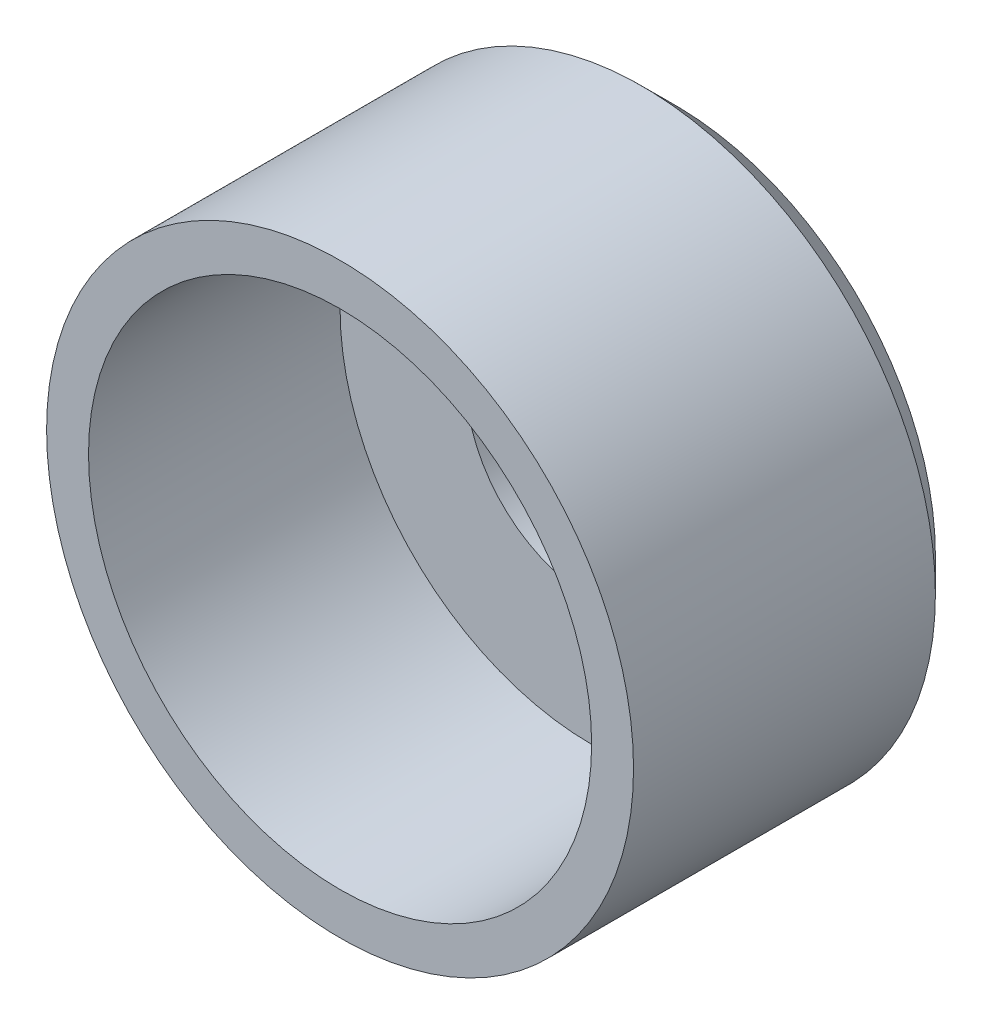
ISO-10303-21;
HEADER;
FILE_DESCRIPTION(('STEP AP214'),'2;1');
FILE_NAME('part.step','',(''),(''),'','','');
FILE_SCHEMA(('AUTOMOTIVE_DESIGN { 1 0 10303 214 1 1 1 1 }'));
ENDSEC;
DATA;
#1=APPLICATION_CONTEXT('core data for automotive mechanical design processes');
#2=APPLICATION_PROTOCOL_DEFINITION('international standard','automotive_design',2000,#1);
#3=PRODUCT_CONTEXT('',#1,'mechanical');
#4=PRODUCT('Part','Part','',(#3));
#5=PRODUCT_RELATED_PRODUCT_CATEGORY('part','',(#4));
#6=PRODUCT_DEFINITION_FORMATION('','',#4);
#7=PRODUCT_DEFINITION_CONTEXT('part definition',#1,'design');
#8=PRODUCT_DEFINITION('design','',#6,#7);
#9=PRODUCT_DEFINITION_SHAPE('','',#8);
#10=(LENGTH_UNIT() NAMED_UNIT(*) SI_UNIT(.MILLI.,.METRE.));
#11=(NAMED_UNIT(*) PLANE_ANGLE_UNIT() SI_UNIT($,.RADIAN.));
#12=(NAMED_UNIT(*) SI_UNIT($,.STERADIAN.) SOLID_ANGLE_UNIT());
#13=UNCERTAINTY_MEASURE_WITH_UNIT(LENGTH_MEASURE(1.E-05),#10,'distance_accuracy_value','');
#14=(GEOMETRIC_REPRESENTATION_CONTEXT(3) GLOBAL_UNCERTAINTY_ASSIGNED_CONTEXT((#13)) GLOBAL_UNIT_ASSIGNED_CONTEXT((#10,
#11,#12)) REPRESENTATION_CONTEXT('',''));
#15=CARTESIAN_POINT('',(0.,0.,0.));
#16=DIRECTION('',(0.,0.,1.));
#17=DIRECTION('',(1.,0.,0.));
#18=AXIS2_PLACEMENT_3D('',#15,#16,#17);
#19=CARTESIAN_POINT('',(0.,0.,5.));
#20=DIRECTION('',(0.,0.,-1.));
#21=DIRECTION('',(-1.,0.,0.));
#22=AXIS2_PLACEMENT_3D('',#19,#20,#21);
#23=CYLINDRICAL_SURFACE('',#22,17.5);
#24=CARTESIAN_POINT('',(0.,0.,2.));
#25=DIRECTION('',(0.,0.,1.));
#26=DIRECTION('',(1.,0.,0.));
#27=AXIS2_PLACEMENT_3D('',#24,#25,#26);
#28=CIRCLE('',#27,17.5);
#29=CARTESIAN_POINT('',(17.5,0.,2.));
#30=VERTEX_POINT('',#29);
#31=EDGE_CURVE('E44',#30,#30,#28,.T.);
#32=ORIENTED_EDGE('',*,*,#31,.T.);
#33=EDGE_LOOP('',(#32));
#34=FACE_BOUND('',#33,.T.);
#35=CARTESIAN_POINT('',(0.,0.,20.));
#36=DIRECTION('',(0.,0.,1.));
#37=DIRECTION('',(1.,0.,0.));
#38=AXIS2_PLACEMENT_3D('',#35,#36,#37);
#39=CIRCLE('',#38,17.5);
#40=CARTESIAN_POINT('',(17.5,0.,20.));
#41=VERTEX_POINT('',#40);
#42=EDGE_CURVE('E52',#41,#41,#39,.T.);
#43=ORIENTED_EDGE('',*,*,#42,.F.);
#44=EDGE_LOOP('',(#43));
#45=FACE_BOUND('',#44,.T.);
#46=ADVANCED_FACE('F37',(#34,#45),#23,.T.);
#47=CARTESIAN_POINT('',(0.,0.,0.));
#48=DIRECTION('',(0.,0.,1.));
#49=DIRECTION('',(1.,0.,0.));
#50=AXIS2_PLACEMENT_3D('',#47,#48,#49);
#51=PLANE('',#50);
#52=CARTESIAN_POINT('',(0.,0.,0.));
#53=DIRECTION('',(0.,0.,1.));
#54=DIRECTION('',(1.,0.,0.));
#55=AXIS2_PLACEMENT_3D('',#52,#53,#54);
#56=CIRCLE('',#55,15.5);
#57=CARTESIAN_POINT('',(15.5,0.,0.));
#58=VERTEX_POINT('',#57);
#59=EDGE_CURVE('E10',#58,#58,#56,.F.);
#60=ORIENTED_EDGE('',*,*,#59,.T.);
#61=EDGE_LOOP('',(#60));
#62=FACE_BOUND('',#61,.T.);
#63=CARTESIAN_POINT('',(0.,0.,0.));
#64=DIRECTION('',(0.,0.,-1.));
#65=DIRECTION('',(-1.,0.,0.));
#66=AXIS2_PLACEMENT_3D('',#63,#64,#65);
#67=CIRCLE('',#66,7.5);
#68=CARTESIAN_POINT('',(-7.5,0.,0.));
#69=VERTEX_POINT('',#68);
#70=EDGE_CURVE('E58',#69,#69,#67,.T.);
#71=ORIENTED_EDGE('',*,*,#70,.F.);
#72=EDGE_LOOP('',(#71));
#73=FACE_BOUND('',#72,.T.);
#74=ADVANCED_FACE('F69',(#62,#73),#51,.F.);
#75=CARTESIAN_POINT('',(0.,0.,20.));
#76=DIRECTION('',(0.,0.,1.));
#77=DIRECTION('',(1.,0.,0.));
#78=AXIS2_PLACEMENT_3D('',#75,#76,#77);
#79=PLANE('',#78);
#80=ORIENTED_EDGE('',*,*,#42,.T.);
#81=EDGE_LOOP('',(#80));
#82=FACE_BOUND('',#81,.T.);
#83=CARTESIAN_POINT('',(0.,0.,20.));
#84=DIRECTION('',(0.,0.,1.));
#85=DIRECTION('',(1.,0.,0.));
#86=AXIS2_PLACEMENT_3D('',#83,#84,#85);
#87=CIRCLE('',#86,15.);
#88=CARTESIAN_POINT('',(15.,0.,20.));
#89=VERTEX_POINT('',#88);
#90=EDGE_CURVE('E57',#89,#89,#87,.T.);
#91=ORIENTED_EDGE('',*,*,#90,.F.);
#92=EDGE_LOOP('',(#91));
#93=FACE_BOUND('',#92,.T.);
#94=ADVANCED_FACE('F71',(#82,#93),#79,.T.);
#95=CARTESIAN_POINT('',(0.,0.,20.));
#96=DIRECTION('',(0.,0.,-1.));
#97=DIRECTION('',(-1.,0.,0.));
#98=AXIS2_PLACEMENT_3D('',#95,#96,#97);
#99=CYLINDRICAL_SURFACE('',#98,15.);
#100=ORIENTED_EDGE('',*,*,#90,.T.);
#101=EDGE_LOOP('',(#100));
#102=FACE_BOUND('',#101,.T.);
#103=CARTESIAN_POINT('',(0.,0.,5.));
#104=DIRECTION('',(0.,0.,1.));
#105=DIRECTION('',(1.,0.,0.));
#106=AXIS2_PLACEMENT_3D('',#103,#104,#105);
#107=CIRCLE('',#106,15.);
#108=CARTESIAN_POINT('',(15.,0.,5.));
#109=VERTEX_POINT('',#108);
#110=EDGE_CURVE('E48',#109,#109,#107,.F.);
#111=ORIENTED_EDGE('',*,*,#110,.T.);
#112=EDGE_LOOP('',(#111));
#113=FACE_BOUND('',#112,.T.);
#114=ADVANCED_FACE('F77',(#102,#113),#99,.F.);
#115=CARTESIAN_POINT('',(0.,0.,5.));
#116=DIRECTION('',(0.,0.,1.));
#117=DIRECTION('',(1.,0.,0.));
#118=AXIS2_PLACEMENT_3D('',#115,#116,#117);
#119=PLANE('',#118);
#120=CARTESIAN_POINT('',(0.,0.,5.));
#121=DIRECTION('',(0.,0.,1.));
#122=DIRECTION('',(1.,0.,0.));
#123=AXIS2_PLACEMENT_3D('',#120,#121,#122);
#124=CIRCLE('',#123,7.5);
#125=CARTESIAN_POINT('',(7.5,0.,5.));
#126=VERTEX_POINT('',#125);
#127=EDGE_CURVE('E55',#126,#126,#124,.T.);
#128=ORIENTED_EDGE('',*,*,#127,.F.);
#129=EDGE_LOOP('',(#128));
#130=FACE_BOUND('',#129,.T.);
#131=ORIENTED_EDGE('',*,*,#110,.F.);
#132=EDGE_LOOP('',(#131));
#133=FACE_BOUND('',#132,.T.);
#134=ADVANCED_FACE('F81',(#130,#133),#119,.T.);
#135=CARTESIAN_POINT('',(0.,0.,20.));
#136=DIRECTION('',(0.,0.,-1.));
#137=DIRECTION('',(-1.,0.,0.));
#138=AXIS2_PLACEMENT_3D('',#135,#136,#137);
#139=CYLINDRICAL_SURFACE('',#138,7.5);
#140=ORIENTED_EDGE('',*,*,#127,.T.);
#141=EDGE_LOOP('',(#140));
#142=FACE_BOUND('',#141,.T.);
#143=ORIENTED_EDGE('',*,*,#70,.T.);
#144=EDGE_LOOP('',(#143));
#145=FACE_BOUND('',#144,.T.);
#146=ADVANCED_FACE('F67',(#142,#145),#139,.F.);
#147=CARTESIAN_POINT('',(0.,0.,2.));
#148=DIRECTION('',(0.,0.,1.));
#149=DIRECTION('',(1.,0.,0.));
#150=AXIS2_PLACEMENT_3D('',#147,#148,#149);
#151=CONICAL_SURFACE('',#150,17.5,0.785398163397452);
#152=ORIENTED_EDGE('',*,*,#59,.F.);
#153=EDGE_LOOP('',(#152));
#154=FACE_BOUND('',#153,.T.);
#155=ORIENTED_EDGE('',*,*,#31,.F.);
#156=EDGE_LOOP('',(#155));
#157=FACE_BOUND('',#156,.T.);
#158=ADVANCED_FACE('F39',(#154,#157),#151,.T.);
#159=CLOSED_SHELL('',(#46,#74,#94,#114,#134,#146,#158));
#160=MANIFOLD_SOLID_BREP('B2',#159);
#161=ADVANCED_BREP_SHAPE_REPRESENTATION('',(#18,#160),#14);
#162=SHAPE_DEFINITION_REPRESENTATION(#9,#161);
ENDSEC;
END-ISO-10303-21;
